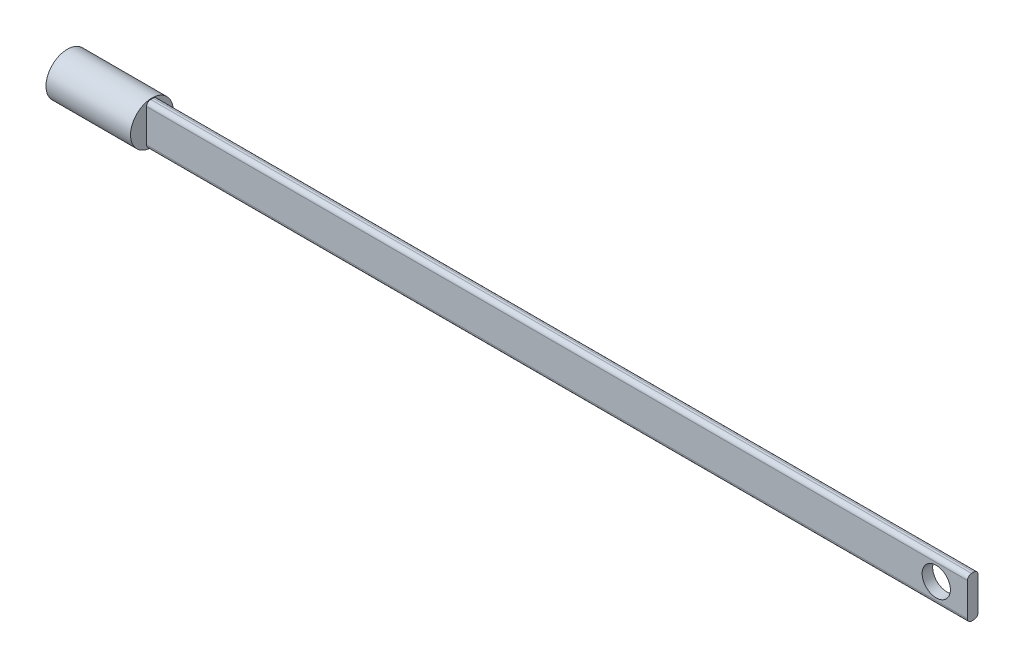
ISO-10303-21;
HEADER;
FILE_DESCRIPTION(('STEP AP214'),'2;1');
FILE_NAME('part.step','',(''),(''),'','','');
FILE_SCHEMA(('AUTOMOTIVE_DESIGN { 1 0 10303 214 1 1 1 1 }'));
ENDSEC;
DATA;
#1=APPLICATION_CONTEXT('core data for automotive mechanical design processes');
#2=APPLICATION_PROTOCOL_DEFINITION('international standard','automotive_design',2000,#1);
#3=PRODUCT_CONTEXT('',#1,'mechanical');
#4=PRODUCT('Part','Part','',(#3));
#5=PRODUCT_RELATED_PRODUCT_CATEGORY('part','',(#4));
#6=PRODUCT_DEFINITION_FORMATION('','',#4);
#7=PRODUCT_DEFINITION_CONTEXT('part definition',#1,'design');
#8=PRODUCT_DEFINITION('design','',#6,#7);
#9=PRODUCT_DEFINITION_SHAPE('','',#8);
#10=(LENGTH_UNIT() NAMED_UNIT(*) SI_UNIT(.MILLI.,.METRE.));
#11=(NAMED_UNIT(*) PLANE_ANGLE_UNIT() SI_UNIT($,.RADIAN.));
#12=(NAMED_UNIT(*) SI_UNIT($,.STERADIAN.) SOLID_ANGLE_UNIT());
#13=UNCERTAINTY_MEASURE_WITH_UNIT(LENGTH_MEASURE(1.E-05),#10,'distance_accuracy_value','');
#14=(GEOMETRIC_REPRESENTATION_CONTEXT(3) GLOBAL_UNCERTAINTY_ASSIGNED_CONTEXT((#13)) GLOBAL_UNIT_ASSIGNED_CONTEXT((#10,
#11,#12)) REPRESENTATION_CONTEXT('',''));
#15=CARTESIAN_POINT('',(0.,0.,0.));
#16=DIRECTION('',(0.,0.,1.));
#17=DIRECTION('',(1.,0.,0.));
#18=AXIS2_PLACEMENT_3D('',#15,#16,#17);
#19=CARTESIAN_POINT('',(26.162,0.,0.));
#20=DIRECTION('',(-1.,0.,0.));
#21=DIRECTION('',(0.,0.,1.));
#22=AXIS2_PLACEMENT_3D('',#19,#20,#21);
#23=CYLINDRICAL_SURFACE('',#22,6.604);
#24=CARTESIAN_POINT('',(26.162,0.,0.));
#25=DIRECTION('',(1.,0.,0.));
#26=DIRECTION('',(0.,0.,-1.));
#27=AXIS2_PLACEMENT_3D('',#24,#25,#26);
#28=CIRCLE('',#27,6.604);
#29=CARTESIAN_POINT('',(26.162,6.39960032572191,-1.63031643278845));
#30=VERTEX_POINT('',#29);
#31=CARTESIAN_POINT('',(26.162,6.39960032572191,1.63031643278845));
#32=VERTEX_POINT('',#31);
#33=EDGE_CURVE('E118',#30,#32,#28,.T.);
#34=ORIENTED_EDGE('',*,*,#33,.F.);
#35=CARTESIAN_POINT('',(26.162,-6.39960032572191,-1.63031643278845));
#36=VERTEX_POINT('',#35);
#37=EDGE_CURVE('E124',#36,#30,#28,.T.);
#38=ORIENTED_EDGE('',*,*,#37,.F.);
#39=CARTESIAN_POINT('',(26.162,-6.39960032572191,1.63031643278845));
#40=VERTEX_POINT('',#39);
#41=EDGE_CURVE('E130',#40,#36,#28,.T.);
#42=ORIENTED_EDGE('',*,*,#41,.F.);
#43=EDGE_CURVE('E123',#32,#40,#28,.T.);
#44=ORIENTED_EDGE('',*,*,#43,.F.);
#45=EDGE_LOOP('',(#34,#38,#42,#44));
#46=FACE_BOUND('',#45,.T.);
#47=CARTESIAN_POINT('',(0.,0.,0.));
#48=DIRECTION('',(1.,0.,0.));
#49=DIRECTION('',(0.,0.,-1.));
#50=AXIS2_PLACEMENT_3D('',#47,#48,#49);
#51=CIRCLE('',#50,6.604);
#52=CARTESIAN_POINT('',(0.,0.,-6.604));
#53=VERTEX_POINT('',#52);
#54=EDGE_CURVE('E137',#53,#53,#51,.T.);
#55=ORIENTED_EDGE('',*,*,#54,.T.);
#56=EDGE_LOOP('',(#55));
#57=FACE_BOUND('',#56,.T.);
#58=ADVANCED_FACE('F39',(#46,#57),#23,.T.);
#59=CARTESIAN_POINT('',(26.162,0.,0.));
#60=DIRECTION('',(1.,0.,0.));
#61=DIRECTION('',(0.,0.,-1.));
#62=AXIS2_PLACEMENT_3D('',#59,#60,#61);
#63=PLANE('',#62);
#64=ORIENTED_EDGE('',*,*,#33,.T.);
#65=ORIENTED_EDGE('',*,*,#43,.T.);
#66=ORIENTED_EDGE('',*,*,#41,.T.);
#67=ORIENTED_EDGE('',*,*,#37,.T.);
#68=EDGE_LOOP('',(#64,#65,#66,#67));
#69=FACE_BOUND('',#68,.T.);
#70=DIRECTION('',(0.,0.,1.));
#71=VECTOR('',#70,1.);
#72=CARTESIAN_POINT('',(26.162,6.39960032572191,1.63031643278845));
#73=LINE('',#72,#71);
#74=CARTESIAN_POINT('',(26.162,6.39960032572191,-0.360316432788448));
#75=VERTEX_POINT('',#74);
#76=CARTESIAN_POINT('',(26.162,6.39960032572191,0.360316432788448));
#77=VERTEX_POINT('',#76);
#78=EDGE_CURVE('E55',#75,#77,#73,.T.);
#79=ORIENTED_EDGE('',*,*,#78,.F.);
#80=CARTESIAN_POINT('',(26.162,5.12960032572191,-0.360316432788448));
#81=DIRECTION('',(1.,0.,0.));
#82=DIRECTION('',(0.,0.,-1.));
#83=AXIS2_PLACEMENT_3D('',#80,#81,#82);
#84=CIRCLE('',#83,1.27);
#85=CARTESIAN_POINT('',(26.162,5.12960032572191,-1.63031643278845));
#86=VERTEX_POINT('',#85);
#87=EDGE_CURVE('E183',#75,#86,#84,.F.);
#88=ORIENTED_EDGE('',*,*,#87,.T.);
#89=DIRECTION('',(0.,1.,0.));
#90=VECTOR('',#89,1.);
#91=CARTESIAN_POINT('',(26.162,-6.39960032572191,-1.63031643278845));
#92=LINE('',#91,#90);
#93=CARTESIAN_POINT('',(26.162,-5.12960032572191,-1.63031643278845));
#94=VERTEX_POINT('',#93);
#95=EDGE_CURVE('E216',#94,#86,#92,.T.);
#96=ORIENTED_EDGE('',*,*,#95,.F.);
#97=CARTESIAN_POINT('',(26.162,-5.12960032572191,-0.360316432788448));
#98=DIRECTION('',(1.,0.,0.));
#99=DIRECTION('',(0.,0.,-1.));
#100=AXIS2_PLACEMENT_3D('',#97,#98,#99);
#101=CIRCLE('',#100,1.27);
#102=CARTESIAN_POINT('',(26.162,-6.39960032572191,-0.360316432788448));
#103=VERTEX_POINT('',#102);
#104=EDGE_CURVE('E179',#94,#103,#101,.F.);
#105=ORIENTED_EDGE('',*,*,#104,.T.);
#106=DIRECTION('',(0.,0.,-1.));
#107=VECTOR('',#106,1.);
#108=CARTESIAN_POINT('',(26.162,-6.39960032572191,1.63031643278845));
#109=LINE('',#108,#107);
#110=CARTESIAN_POINT('',(26.162,-6.39960032572191,0.360316432788448));
#111=VERTEX_POINT('',#110);
#112=EDGE_CURVE('E189',#111,#103,#109,.T.);
#113=ORIENTED_EDGE('',*,*,#112,.F.);
#114=CARTESIAN_POINT('',(26.162,-5.12960032572191,0.360316432788448));
#115=DIRECTION('',(1.,0.,0.));
#116=DIRECTION('',(0.,0.,-1.));
#117=AXIS2_PLACEMENT_3D('',#114,#115,#116);
#118=CIRCLE('',#117,1.27);
#119=CARTESIAN_POINT('',(26.162,-5.12960032572191,1.63031643278845));
#120=VERTEX_POINT('',#119);
#121=EDGE_CURVE('E48',#111,#120,#118,.F.);
#122=ORIENTED_EDGE('',*,*,#121,.T.);
#123=DIRECTION('',(0.,-1.,0.));
#124=VECTOR('',#123,1.);
#125=CARTESIAN_POINT('',(26.162,-6.39960032572191,1.63031643278845));
#126=LINE('',#125,#124);
#127=CARTESIAN_POINT('',(26.162,5.12960032572191,1.63031643278845));
#128=VERTEX_POINT('',#127);
#129=EDGE_CURVE('E62',#128,#120,#126,.T.);
#130=ORIENTED_EDGE('',*,*,#129,.F.);
#131=CARTESIAN_POINT('',(26.162,5.12960032572191,0.360316432788448));
#132=DIRECTION('',(1.,0.,0.));
#133=DIRECTION('',(0.,0.,-1.));
#134=AXIS2_PLACEMENT_3D('',#131,#132,#133);
#135=CIRCLE('',#134,1.27);
#136=EDGE_CURVE('E11',#128,#77,#135,.F.);
#137=ORIENTED_EDGE('',*,*,#136,.T.);
#138=EDGE_LOOP('',(#79,#88,#96,#105,#113,#122,#130,#137));
#139=FACE_BOUND('',#138,.T.);
#140=ADVANCED_FACE('F120',(#69,#139),#63,.T.);
#141=CARTESIAN_POINT('',(0.,0.,0.));
#142=DIRECTION('',(1.,0.,0.));
#143=DIRECTION('',(0.,0.,-1.));
#144=AXIS2_PLACEMENT_3D('',#141,#142,#143);
#145=PLANE('',#144);
#146=CARTESIAN_POINT('',(0.,0.,0.));
#147=DIRECTION('',(-1.,0.,0.));
#148=DIRECTION('',(0.,0.,1.));
#149=AXIS2_PLACEMENT_3D('',#146,#147,#148);
#150=CIRCLE('',#149,4.60295306933741);
#151=CARTESIAN_POINT('',(0.,0.,4.60295306933741));
#152=VERTEX_POINT('',#151);
#153=EDGE_CURVE('E135',#152,#152,#150,.T.);
#154=ORIENTED_EDGE('',*,*,#153,.F.);
#155=EDGE_LOOP('',(#154));
#156=FACE_BOUND('',#155,.T.);
#157=ORIENTED_EDGE('',*,*,#54,.F.);
#158=EDGE_LOOP('',(#157));
#159=FACE_BOUND('',#158,.T.);
#160=ADVANCED_FACE('F235',(#156,#159),#145,.F.);
#161=CARTESIAN_POINT('',(11.684,0.,0.));
#162=DIRECTION('',(-1.,0.,0.));
#163=DIRECTION('',(0.,0.,1.));
#164=AXIS2_PLACEMENT_3D('',#161,#162,#163);
#165=CYLINDRICAL_SURFACE('',#164,4.60295306933741);
#166=CARTESIAN_POINT('',(11.684,0.,0.));
#167=DIRECTION('',(-1.,0.,0.));
#168=DIRECTION('',(0.,0.,1.));
#169=AXIS2_PLACEMENT_3D('',#166,#167,#168);
#170=CIRCLE('',#169,4.60295306933741);
#171=CARTESIAN_POINT('',(11.684,0.,4.60295306933741));
#172=VERTEX_POINT('',#171);
#173=EDGE_CURVE('E141',#172,#172,#170,.T.);
#174=ORIENTED_EDGE('',*,*,#173,.F.);
#175=EDGE_LOOP('',(#174));
#176=FACE_BOUND('',#175,.T.);
#177=ORIENTED_EDGE('',*,*,#153,.T.);
#178=EDGE_LOOP('',(#177));
#179=FACE_BOUND('',#178,.T.);
#180=ADVANCED_FACE('F233',(#176,#179),#165,.F.);
#181=CARTESIAN_POINT('',(11.684,0.,0.));
#182=DIRECTION('',(-1.,0.,0.));
#183=DIRECTION('',(0.,0.,1.));
#184=AXIS2_PLACEMENT_3D('',#181,#182,#183);
#185=PLANE('',#184);
#186=ORIENTED_EDGE('',*,*,#173,.T.);
#187=EDGE_LOOP('',(#186));
#188=FACE_BOUND('',#187,.T.);
#189=ADVANCED_FACE('F303',(#188),#185,.T.);
#190=CARTESIAN_POINT('',(280.162,-6.39960032572191,-1.63031643278845));
#191=DIRECTION('',(0.,0.,1.));
#192=DIRECTION('',(1.,0.,0.));
#193=AXIS2_PLACEMENT_3D('',#190,#191,#192);
#194=PLANE('',#193);
#195=CARTESIAN_POINT('',(270.502993622445,0.,-1.63031643278845));
#196=DIRECTION('',(0.,0.,1.));
#197=DIRECTION('',(1.,0.,0.));
#198=AXIS2_PLACEMENT_3D('',#195,#196,#197);
#199=CIRCLE('',#198,4.36879999999999);
#200=CARTESIAN_POINT('',(274.871793622445,0.,-1.63031643278845));
#201=VERTEX_POINT('',#200);
#202=EDGE_CURVE('E219',#201,#201,#199,.F.);
#203=ORIENTED_EDGE('',*,*,#202,.F.);
#204=EDGE_LOOP('',(#203));
#205=FACE_BOUND('',#204,.T.);
#206=DIRECTION('',(0.,1.,0.));
#207=VECTOR('',#206,1.);
#208=CARTESIAN_POINT('',(280.162,-6.39960032572191,-1.63031643278845));
#209=LINE('',#208,#207);
#210=CARTESIAN_POINT('',(280.162,-5.12960032572191,-1.63031643278845));
#211=VERTEX_POINT('',#210);
#212=CARTESIAN_POINT('',(280.162,5.12960032572191,-1.63031643278845));
#213=VERTEX_POINT('',#212);
#214=EDGE_CURVE('E212',#211,#213,#209,.T.);
#215=ORIENTED_EDGE('',*,*,#214,.F.);
#216=DIRECTION('',(-1.,0.,0.));
#217=VECTOR('',#216,1.);
#218=CARTESIAN_POINT('',(280.162,-5.12960032572191,-1.63031643278845));
#219=LINE('',#218,#217);
#220=EDGE_CURVE('E144',#211,#94,#219,.T.);
#221=ORIENTED_EDGE('',*,*,#220,.T.);
#222=ORIENTED_EDGE('',*,*,#95,.T.);
#223=DIRECTION('',(-1.,0.,0.));
#224=VECTOR('',#223,1.);
#225=CARTESIAN_POINT('',(280.162,5.12960032572191,-1.63031643278845));
#226=LINE('',#225,#224);
#227=EDGE_CURVE('E127',#86,#213,#226,.F.);
#228=ORIENTED_EDGE('',*,*,#227,.T.);
#229=EDGE_LOOP('',(#215,#221,#222,#228));
#230=FACE_BOUND('',#229,.T.);
#231=ADVANCED_FACE('F273',(#205,#230),#194,.F.);
#232=CARTESIAN_POINT('',(280.162,6.39960032572191,1.63031643278845));
#233=DIRECTION('',(0.,-1.,0.));
#234=DIRECTION('',(0.,0.,-1.));
#235=AXIS2_PLACEMENT_3D('',#232,#233,#234);
#236=PLANE('',#235);
#237=DIRECTION('',(0.,0.,1.));
#238=VECTOR('',#237,1.);
#239=CARTESIAN_POINT('',(280.162,6.39960032572191,1.63031643278845));
#240=LINE('',#239,#238);
#241=CARTESIAN_POINT('',(280.162,6.39960032572191,-0.360316432788448));
#242=VERTEX_POINT('',#241);
#243=CARTESIAN_POINT('',(280.162,6.39960032572191,0.360316432788448));
#244=VERTEX_POINT('',#243);
#245=EDGE_CURVE('E207',#242,#244,#240,.T.);
#246=ORIENTED_EDGE('',*,*,#245,.F.);
#247=DIRECTION('',(-1.,0.,0.));
#248=VECTOR('',#247,1.);
#249=CARTESIAN_POINT('',(280.162,6.39960032572191,-0.360316432788448));
#250=LINE('',#249,#248);
#251=EDGE_CURVE('E170',#242,#75,#250,.T.);
#252=ORIENTED_EDGE('',*,*,#251,.T.);
#253=ORIENTED_EDGE('',*,*,#78,.T.);
#254=DIRECTION('',(-1.,0.,0.));
#255=VECTOR('',#254,1.);
#256=CARTESIAN_POINT('',(280.162,6.39960032572191,0.360316432788448));
#257=LINE('',#256,#255);
#258=EDGE_CURVE('E167',#77,#244,#257,.F.);
#259=ORIENTED_EDGE('',*,*,#258,.T.);
#260=EDGE_LOOP('',(#246,#252,#253,#259));
#261=FACE_BOUND('',#260,.T.);
#262=ADVANCED_FACE('F290',(#261),#236,.F.);
#263=CARTESIAN_POINT('',(280.162,-6.39960032572191,1.63031643278845));
#264=DIRECTION('',(0.,0.,-1.));
#265=DIRECTION('',(-1.,0.,0.));
#266=AXIS2_PLACEMENT_3D('',#263,#264,#265);
#267=PLANE('',#266);
#268=CARTESIAN_POINT('',(270.502993622445,0.,1.63031643278845));
#269=DIRECTION('',(0.,0.,1.));
#270=DIRECTION('',(1.,0.,0.));
#271=AXIS2_PLACEMENT_3D('',#268,#269,#270);
#272=CIRCLE('',#271,4.36879999999999);
#273=CARTESIAN_POINT('',(274.871793622445,0.,1.63031643278845));
#274=VERTEX_POINT('',#273);
#275=EDGE_CURVE('E282',#274,#274,#272,.T.);
#276=ORIENTED_EDGE('',*,*,#275,.F.);
#277=EDGE_LOOP('',(#276));
#278=FACE_BOUND('',#277,.T.);
#279=ORIENTED_EDGE('',*,*,#129,.T.);
#280=DIRECTION('',(-1.,0.,0.));
#281=VECTOR('',#280,1.);
#282=CARTESIAN_POINT('',(280.162,-5.12960032572191,1.63031643278845));
#283=LINE('',#282,#281);
#284=CARTESIAN_POINT('',(280.162,-5.12960032572191,1.63031643278845));
#285=VERTEX_POINT('',#284);
#286=EDGE_CURVE('E176',#120,#285,#283,.F.);
#287=ORIENTED_EDGE('',*,*,#286,.T.);
#288=DIRECTION('',(0.,-1.,0.));
#289=VECTOR('',#288,1.);
#290=CARTESIAN_POINT('',(280.162,-6.39960032572191,1.63031643278845));
#291=LINE('',#290,#289);
#292=CARTESIAN_POINT('',(280.162,5.12960032572191,1.63031643278845));
#293=VERTEX_POINT('',#292);
#294=EDGE_CURVE('E197',#293,#285,#291,.T.);
#295=ORIENTED_EDGE('',*,*,#294,.F.);
#296=DIRECTION('',(-1.,0.,0.));
#297=VECTOR('',#296,1.);
#298=CARTESIAN_POINT('',(280.162,5.12960032572191,1.63031643278845));
#299=LINE('',#298,#297);
#300=EDGE_CURVE('E173',#293,#128,#299,.T.);
#301=ORIENTED_EDGE('',*,*,#300,.T.);
#302=EDGE_LOOP('',(#279,#287,#295,#301));
#303=FACE_BOUND('',#302,.T.);
#304=ADVANCED_FACE('F196',(#278,#303),#267,.F.);
#305=CARTESIAN_POINT('',(280.162,-6.39960032572191,1.63031643278845));
#306=DIRECTION('',(0.,1.,0.));
#307=DIRECTION('',(0.,0.,1.));
#308=AXIS2_PLACEMENT_3D('',#305,#306,#307);
#309=PLANE('',#308);
#310=ORIENTED_EDGE('',*,*,#112,.T.);
#311=DIRECTION('',(-1.,0.,0.));
#312=VECTOR('',#311,1.);
#313=CARTESIAN_POINT('',(280.162,-6.39960032572191,-0.360316432788448));
#314=LINE('',#313,#312);
#315=CARTESIAN_POINT('',(280.162,-6.39960032572191,-0.360316432788448));
#316=VERTEX_POINT('',#315);
#317=EDGE_CURVE('E152',#103,#316,#314,.F.);
#318=ORIENTED_EDGE('',*,*,#317,.T.);
#319=DIRECTION('',(0.,0.,-1.));
#320=VECTOR('',#319,1.);
#321=CARTESIAN_POINT('',(280.162,-6.39960032572191,1.63031643278845));
#322=LINE('',#321,#320);
#323=CARTESIAN_POINT('',(280.162,-6.39960032572191,0.360316432788448));
#324=VERTEX_POINT('',#323);
#325=EDGE_CURVE('E206',#324,#316,#322,.T.);
#326=ORIENTED_EDGE('',*,*,#325,.F.);
#327=DIRECTION('',(-1.,0.,0.));
#328=VECTOR('',#327,1.);
#329=CARTESIAN_POINT('',(280.162,-6.39960032572191,0.360316432788448));
#330=LINE('',#329,#328);
#331=EDGE_CURVE('E148',#324,#111,#330,.T.);
#332=ORIENTED_EDGE('',*,*,#331,.T.);
#333=EDGE_LOOP('',(#310,#318,#326,#332));
#334=FACE_BOUND('',#333,.T.);
#335=ADVANCED_FACE('F289',(#334),#309,.F.);
#336=CARTESIAN_POINT('',(280.162,0.,0.));
#337=DIRECTION('',(-1.,0.,0.));
#338=DIRECTION('',(0.,0.,1.));
#339=AXIS2_PLACEMENT_3D('',#336,#337,#338);
#340=PLANE('',#339);
#341=ORIENTED_EDGE('',*,*,#325,.T.);
#342=CARTESIAN_POINT('',(280.162,-5.12960032572191,-0.360316432788448));
#343=DIRECTION('',(-1.,0.,0.));
#344=DIRECTION('',(0.,0.,1.));
#345=AXIS2_PLACEMENT_3D('',#342,#343,#344);
#346=CIRCLE('',#345,1.27);
#347=EDGE_CURVE('E164',#316,#211,#346,.F.);
#348=ORIENTED_EDGE('',*,*,#347,.T.);
#349=ORIENTED_EDGE('',*,*,#214,.T.);
#350=CARTESIAN_POINT('',(280.162,5.12960032572191,-0.360316432788448));
#351=DIRECTION('',(-1.,0.,0.));
#352=DIRECTION('',(0.,0.,1.));
#353=AXIS2_PLACEMENT_3D('',#350,#351,#352);
#354=CIRCLE('',#353,1.27);
#355=EDGE_CURVE('E161',#213,#242,#354,.F.);
#356=ORIENTED_EDGE('',*,*,#355,.T.);
#357=ORIENTED_EDGE('',*,*,#245,.T.);
#358=CARTESIAN_POINT('',(280.162,5.12960032572191,0.360316432788448));
#359=DIRECTION('',(-1.,0.,0.));
#360=DIRECTION('',(0.,0.,1.));
#361=AXIS2_PLACEMENT_3D('',#358,#359,#360);
#362=CIRCLE('',#361,1.27);
#363=EDGE_CURVE('E155',#244,#293,#362,.F.);
#364=ORIENTED_EDGE('',*,*,#363,.T.);
#365=ORIENTED_EDGE('',*,*,#294,.T.);
#366=CARTESIAN_POINT('',(280.162,-5.12960032572191,0.360316432788448));
#367=DIRECTION('',(-1.,0.,0.));
#368=DIRECTION('',(0.,0.,1.));
#369=AXIS2_PLACEMENT_3D('',#366,#367,#368);
#370=CIRCLE('',#369,1.27);
#371=EDGE_CURVE('E158',#285,#324,#370,.F.);
#372=ORIENTED_EDGE('',*,*,#371,.T.);
#373=EDGE_LOOP('',(#341,#348,#349,#356,#357,#364,#365,#372));
#374=FACE_BOUND('',#373,.T.);
#375=ADVANCED_FACE('F201',(#374),#340,.F.);
#376=CARTESIAN_POINT('',(280.162,-5.12960032572191,-0.360316432788448));
#377=DIRECTION('',(-1.,0.,0.));
#378=DIRECTION('',(0.,0.,1.));
#379=AXIS2_PLACEMENT_3D('',#376,#377,#378);
#380=CYLINDRICAL_SURFACE('',#379,1.27);
#381=ORIENTED_EDGE('',*,*,#347,.F.);
#382=ORIENTED_EDGE('',*,*,#317,.F.);
#383=ORIENTED_EDGE('',*,*,#104,.F.);
#384=ORIENTED_EDGE('',*,*,#220,.F.);
#385=EDGE_LOOP('',(#381,#382,#383,#384));
#386=FACE_BOUND('',#385,.T.);
#387=ADVANCED_FACE('F247',(#386),#380,.T.);
#388=CARTESIAN_POINT('',(280.162,5.12960032572191,-0.360316432788448));
#389=DIRECTION('',(-1.,0.,0.));
#390=DIRECTION('',(0.,0.,1.));
#391=AXIS2_PLACEMENT_3D('',#388,#389,#390);
#392=CYLINDRICAL_SURFACE('',#391,1.27);
#393=ORIENTED_EDGE('',*,*,#355,.F.);
#394=ORIENTED_EDGE('',*,*,#227,.F.);
#395=ORIENTED_EDGE('',*,*,#87,.F.);
#396=ORIENTED_EDGE('',*,*,#251,.F.);
#397=EDGE_LOOP('',(#393,#394,#395,#396));
#398=FACE_BOUND('',#397,.T.);
#399=ADVANCED_FACE('F250',(#398),#392,.T.);
#400=CARTESIAN_POINT('',(280.162,-5.12960032572191,0.360316432788448));
#401=DIRECTION('',(-1.,0.,0.));
#402=DIRECTION('',(0.,0.,1.));
#403=AXIS2_PLACEMENT_3D('',#400,#401,#402);
#404=CYLINDRICAL_SURFACE('',#403,1.27);
#405=ORIENTED_EDGE('',*,*,#371,.F.);
#406=ORIENTED_EDGE('',*,*,#286,.F.);
#407=ORIENTED_EDGE('',*,*,#121,.F.);
#408=ORIENTED_EDGE('',*,*,#331,.F.);
#409=EDGE_LOOP('',(#405,#406,#407,#408));
#410=FACE_BOUND('',#409,.T.);
#411=ADVANCED_FACE('F193',(#410),#404,.T.);
#412=CARTESIAN_POINT('',(280.162,5.12960032572191,0.360316432788448));
#413=DIRECTION('',(-1.,0.,0.));
#414=DIRECTION('',(0.,0.,1.));
#415=AXIS2_PLACEMENT_3D('',#412,#413,#414);
#416=CYLINDRICAL_SURFACE('',#415,1.27);
#417=ORIENTED_EDGE('',*,*,#363,.F.);
#418=ORIENTED_EDGE('',*,*,#258,.F.);
#419=ORIENTED_EDGE('',*,*,#136,.F.);
#420=ORIENTED_EDGE('',*,*,#300,.F.);
#421=EDGE_LOOP('',(#417,#418,#419,#420));
#422=FACE_BOUND('',#421,.T.);
#423=ADVANCED_FACE('F41',(#422),#416,.T.);
#424=CARTESIAN_POINT('',(270.502993622445,0.,-6.605));
#425=DIRECTION('',(0.,0.,1.));
#426=DIRECTION('',(1.,0.,0.));
#427=AXIS2_PLACEMENT_3D('',#424,#425,#426);
#428=CYLINDRICAL_SURFACE('',#427,4.36879999999999);
#429=ORIENTED_EDGE('',*,*,#275,.T.);
#430=EDGE_LOOP('',(#429));
#431=FACE_BOUND('',#430,.T.);
#432=ORIENTED_EDGE('',*,*,#202,.T.);
#433=EDGE_LOOP('',(#432));
#434=FACE_BOUND('',#433,.T.);
#435=ADVANCED_FACE('F258',(#431,#434),#428,.F.);
#436=CLOSED_SHELL('',(#58,#140,#160,#180,#189,#231,#262,#304,#335,#375,#387,#399,#411,#423,#435));
#437=MANIFOLD_SOLID_BREP('B2',#436);
#438=ADVANCED_BREP_SHAPE_REPRESENTATION('',(#18,#437),#14);
#439=SHAPE_DEFINITION_REPRESENTATION(#9,#438);
ENDSEC;
END-ISO-10303-21;
